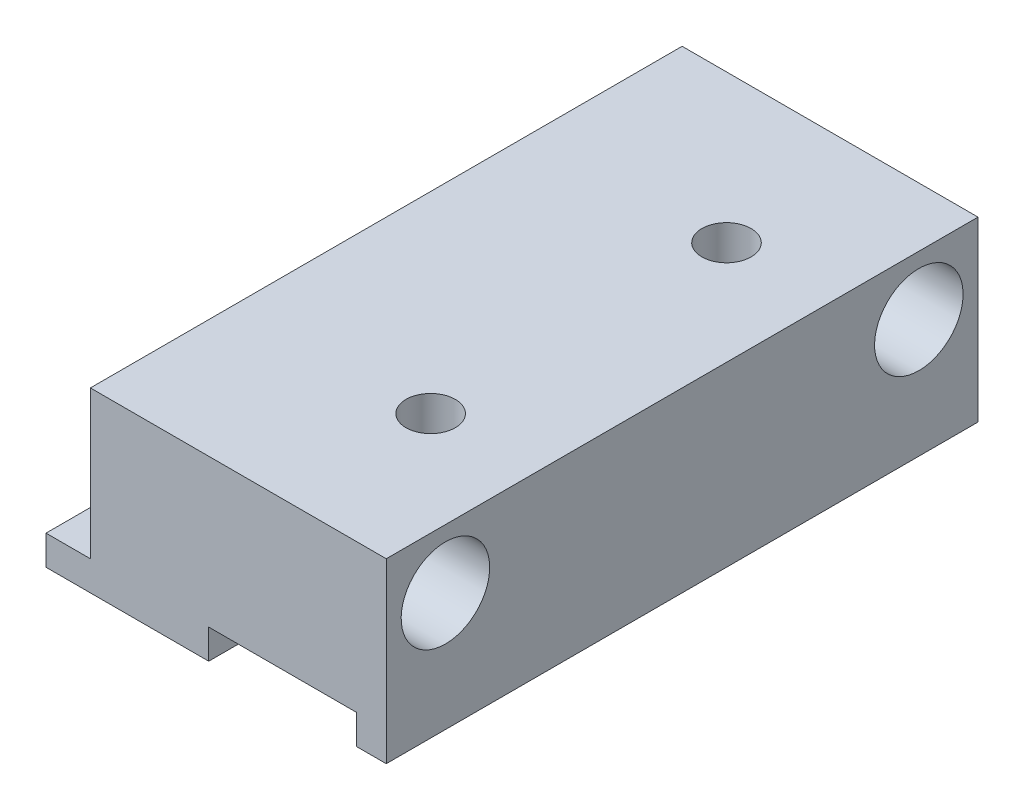
ISO-10303-21;
HEADER;
FILE_DESCRIPTION(('STEP AP214'),'2;1');
FILE_NAME('part.step','',(''),(''),'','','');
FILE_SCHEMA(('AUTOMOTIVE_DESIGN { 1 0 10303 214 1 1 1 1 }'));
ENDSEC;
DATA;
#1=APPLICATION_CONTEXT('core data for automotive mechanical design processes');
#2=APPLICATION_PROTOCOL_DEFINITION('international standard','automotive_design',2000,#1);
#3=PRODUCT_CONTEXT('',#1,'mechanical');
#4=PRODUCT('Part','Part','',(#3));
#5=PRODUCT_RELATED_PRODUCT_CATEGORY('part','',(#4));
#6=PRODUCT_DEFINITION_FORMATION('','',#4);
#7=PRODUCT_DEFINITION_CONTEXT('part definition',#1,'design');
#8=PRODUCT_DEFINITION('design','',#6,#7);
#9=PRODUCT_DEFINITION_SHAPE('','',#8);
#10=(LENGTH_UNIT() NAMED_UNIT(*) SI_UNIT(.MILLI.,.METRE.));
#11=(NAMED_UNIT(*) PLANE_ANGLE_UNIT() SI_UNIT($,.RADIAN.));
#12=(NAMED_UNIT(*) SI_UNIT($,.STERADIAN.) SOLID_ANGLE_UNIT());
#13=UNCERTAINTY_MEASURE_WITH_UNIT(LENGTH_MEASURE(1.E-05),#10,'distance_accuracy_value','');
#14=(GEOMETRIC_REPRESENTATION_CONTEXT(3) GLOBAL_UNCERTAINTY_ASSIGNED_CONTEXT((#13)) GLOBAL_UNIT_ASSIGNED_CONTEXT((#10,
#11,#12)) REPRESENTATION_CONTEXT('',''));
#15=CARTESIAN_POINT('',(0.,0.,0.));
#16=DIRECTION('',(0.,0.,1.));
#17=DIRECTION('',(1.,0.,0.));
#18=AXIS2_PLACEMENT_3D('',#15,#16,#17);
#19=CARTESIAN_POINT('',(-5.27272727272728,3.43181818181817,40.));
#20=DIRECTION('',(1.,0.,0.));
#21=DIRECTION('',(0.,1.,0.));
#22=AXIS2_PLACEMENT_3D('',#19,#20,#21);
#23=PLANE('',#22);
#24=CARTESIAN_POINT('',(-5.27272727272728,-0.568181818181827,36.));
#25=DIRECTION('',(-1.,0.,0.));
#26=DIRECTION('',(0.,-1.,0.));
#27=AXIS2_PLACEMENT_3D('',#24,#25,#26);
#28=CIRCLE('',#27,2.99122974330423);
#29=CARTESIAN_POINT('',(-5.27272727272728,-3.55941156148605,36.));
#30=VERTEX_POINT('',#29);
#31=EDGE_CURVE('E213',#30,#30,#28,.T.);
#32=ORIENTED_EDGE('',*,*,#31,.F.);
#33=EDGE_LOOP('',(#32));
#34=FACE_BOUND('',#33,.T.);
#35=CARTESIAN_POINT('',(-5.27272727272728,-0.568181818181827,4.));
#36=DIRECTION('',(-1.,0.,0.));
#37=DIRECTION('',(0.,-1.,0.));
#38=AXIS2_PLACEMENT_3D('',#35,#36,#37);
#39=CIRCLE('',#38,2.99122974330423);
#40=CARTESIAN_POINT('',(-5.27272727272728,-3.55941156148605,4.));
#41=VERTEX_POINT('',#40);
#42=EDGE_CURVE('E207',#41,#41,#39,.T.);
#43=ORIENTED_EDGE('',*,*,#42,.F.);
#44=EDGE_LOOP('',(#43));
#45=FACE_BOUND('',#44,.T.);
#46=DIRECTION('',(0.,-1.,0.));
#47=VECTOR('',#46,1.);
#48=CARTESIAN_POINT('',(-5.27272727272728,3.43181818181817,0.));
#49=LINE('',#48,#47);
#50=CARTESIAN_POINT('',(-5.27272727272728,3.43181818181817,0.));
#51=VERTEX_POINT('',#50);
#52=CARTESIAN_POINT('',(-5.27272727272728,-6.56818181818183,0.));
#53=VERTEX_POINT('',#52);
#54=EDGE_CURVE('E141',#51,#53,#49,.T.);
#55=ORIENTED_EDGE('',*,*,#54,.T.);
#56=DIRECTION('',(0.,0.,-1.));
#57=VECTOR('',#56,1.);
#58=CARTESIAN_POINT('',(-5.27272727272728,-6.56818181818183,40.));
#59=LINE('',#58,#57);
#60=CARTESIAN_POINT('',(-5.27272727272728,-6.56818181818183,40.));
#61=VERTEX_POINT('',#60);
#62=EDGE_CURVE('E11',#61,#53,#59,.T.);
#63=ORIENTED_EDGE('',*,*,#62,.F.);
#64=DIRECTION('',(0.,-1.,0.));
#65=VECTOR('',#64,1.);
#66=CARTESIAN_POINT('',(-5.27272727272728,3.43181818181817,40.));
#67=LINE('',#66,#65);
#68=CARTESIAN_POINT('',(-5.27272727272728,3.43181818181817,40.));
#69=VERTEX_POINT('',#68);
#70=EDGE_CURVE('E160',#69,#61,#67,.T.);
#71=ORIENTED_EDGE('',*,*,#70,.F.);
#72=DIRECTION('',(0.,0.,-1.));
#73=VECTOR('',#72,1.);
#74=CARTESIAN_POINT('',(-5.27272727272728,3.43181818181817,40.));
#75=LINE('',#74,#73);
#76=EDGE_CURVE('E137',#69,#51,#75,.T.);
#77=ORIENTED_EDGE('',*,*,#76,.T.);
#78=EDGE_LOOP('',(#55,#63,#71,#77));
#79=FACE_BOUND('',#78,.T.);
#80=ADVANCED_FACE('F33',(#34,#45,#79),#23,.F.);
#81=CARTESIAN_POINT('',(-5.27272727272728,-6.56818181818183,40.));
#82=DIRECTION('',(0.,-1.,0.));
#83=DIRECTION('',(0.,0.,-1.));
#84=AXIS2_PLACEMENT_3D('',#81,#82,#83);
#85=PLANE('',#84);
#86=DIRECTION('',(-1.,0.,0.));
#87=VECTOR('',#86,1.);
#88=CARTESIAN_POINT('',(-5.27272727272728,-6.56818181818183,0.));
#89=LINE('',#88,#87);
#90=CARTESIAN_POINT('',(-8.27272727272728,-6.56818181818183,0.));
#91=VERTEX_POINT('',#90);
#92=EDGE_CURVE('E144',#53,#91,#89,.T.);
#93=ORIENTED_EDGE('',*,*,#92,.T.);
#94=DIRECTION('',(0.,0.,-1.));
#95=VECTOR('',#94,1.);
#96=CARTESIAN_POINT('',(-8.27272727272728,-6.56818181818183,40.));
#97=LINE('',#96,#95);
#98=CARTESIAN_POINT('',(-8.27272727272728,-6.56818181818183,40.));
#99=VERTEX_POINT('',#98);
#100=EDGE_CURVE('E41',#99,#91,#97,.T.);
#101=ORIENTED_EDGE('',*,*,#100,.F.);
#102=DIRECTION('',(-1.,0.,0.));
#103=VECTOR('',#102,1.);
#104=CARTESIAN_POINT('',(-5.27272727272728,-6.56818181818183,40.));
#105=LINE('',#104,#103);
#106=EDGE_CURVE('E98',#61,#99,#105,.T.);
#107=ORIENTED_EDGE('',*,*,#106,.F.);
#108=ORIENTED_EDGE('',*,*,#62,.T.);
#109=EDGE_LOOP('',(#93,#101,#107,#108));
#110=FACE_BOUND('',#109,.T.);
#111=ADVANCED_FACE('F259',(#110),#85,.F.);
#112=CARTESIAN_POINT('',(-8.27272727272728,-8.56818181818183,40.));
#113=DIRECTION('',(1.,0.,0.));
#114=DIRECTION('',(0.,0.,-1.));
#115=AXIS2_PLACEMENT_3D('',#112,#113,#114);
#116=PLANE('',#115);
#117=DIRECTION('',(0.,-1.,0.));
#118=VECTOR('',#117,1.);
#119=CARTESIAN_POINT('',(-8.27272727272728,-8.56818181818183,0.));
#120=LINE('',#119,#118);
#121=CARTESIAN_POINT('',(-8.27272727272728,-8.56818181818183,0.));
#122=VERTEX_POINT('',#121);
#123=EDGE_CURVE('E147',#91,#122,#120,.T.);
#124=ORIENTED_EDGE('',*,*,#123,.T.);
#125=DIRECTION('',(0.,0.,-1.));
#126=VECTOR('',#125,1.);
#127=CARTESIAN_POINT('',(-8.27272727272728,-8.56818181818183,40.));
#128=LINE('',#127,#126);
#129=CARTESIAN_POINT('',(-8.27272727272728,-8.56818181818183,40.));
#130=VERTEX_POINT('',#129);
#131=EDGE_CURVE('E173',#130,#122,#128,.T.);
#132=ORIENTED_EDGE('',*,*,#131,.F.);
#133=DIRECTION('',(0.,-1.,0.));
#134=VECTOR('',#133,1.);
#135=CARTESIAN_POINT('',(-8.27272727272728,-8.56818181818183,40.));
#136=LINE('',#135,#134);
#137=EDGE_CURVE('E181',#99,#130,#136,.T.);
#138=ORIENTED_EDGE('',*,*,#137,.F.);
#139=ORIENTED_EDGE('',*,*,#100,.T.);
#140=EDGE_LOOP('',(#124,#132,#138,#139));
#141=FACE_BOUND('',#140,.T.);
#142=ADVANCED_FACE('F179',(#141),#116,.F.);
#143=CARTESIAN_POINT('',(-8.27272727272728,-8.56818181818183,40.));
#144=DIRECTION('',(0.,1.,0.));
#145=DIRECTION('',(0.,0.,1.));
#146=AXIS2_PLACEMENT_3D('',#143,#144,#145);
#147=PLANE('',#146);
#148=DIRECTION('',(1.,0.,0.));
#149=VECTOR('',#148,1.);
#150=CARTESIAN_POINT('',(-8.27272727272728,-8.56818181818183,0.));
#151=LINE('',#150,#149);
#152=CARTESIAN_POINT('',(2.72727272727272,-8.56818181818183,0.));
#153=VERTEX_POINT('',#152);
#154=EDGE_CURVE('E149',#122,#153,#151,.T.);
#155=ORIENTED_EDGE('',*,*,#154,.T.);
#156=DIRECTION('',(0.,0.,-1.));
#157=VECTOR('',#156,1.);
#158=CARTESIAN_POINT('',(2.72727272727272,-8.56818181818183,40.));
#159=LINE('',#158,#157);
#160=CARTESIAN_POINT('',(2.72727272727272,-8.56818181818183,40.));
#161=VERTEX_POINT('',#160);
#162=EDGE_CURVE('E170',#161,#153,#159,.T.);
#163=ORIENTED_EDGE('',*,*,#162,.F.);
#164=DIRECTION('',(1.,0.,0.));
#165=VECTOR('',#164,1.);
#166=CARTESIAN_POINT('',(-8.27272727272728,-8.56818181818183,40.));
#167=LINE('',#166,#165);
#168=EDGE_CURVE('E199',#130,#161,#167,.T.);
#169=ORIENTED_EDGE('',*,*,#168,.F.);
#170=ORIENTED_EDGE('',*,*,#131,.T.);
#171=EDGE_LOOP('',(#155,#163,#169,#170));
#172=FACE_BOUND('',#171,.T.);
#173=ADVANCED_FACE('F190',(#172),#147,.F.);
#174=CARTESIAN_POINT('',(2.72727272727272,-8.56818181818183,40.));
#175=DIRECTION('',(-1.,0.,0.));
#176=DIRECTION('',(0.,0.,1.));
#177=AXIS2_PLACEMENT_3D('',#174,#175,#176);
#178=PLANE('',#177);
#179=DIRECTION('',(0.,1.,0.));
#180=VECTOR('',#179,1.);
#181=CARTESIAN_POINT('',(2.72727272727272,-8.56818181818183,0.));
#182=LINE('',#181,#180);
#183=CARTESIAN_POINT('',(2.72727272727272,-6.56818181818183,0.));
#184=VERTEX_POINT('',#183);
#185=EDGE_CURVE('E151',#153,#184,#182,.T.);
#186=ORIENTED_EDGE('',*,*,#185,.T.);
#187=DIRECTION('',(0.,0.,-1.));
#188=VECTOR('',#187,1.);
#189=CARTESIAN_POINT('',(2.72727272727272,-6.56818181818183,40.));
#190=LINE('',#189,#188);
#191=CARTESIAN_POINT('',(2.72727272727272,-6.56818181818183,40.));
#192=VERTEX_POINT('',#191);
#193=EDGE_CURVE('E167',#192,#184,#190,.T.);
#194=ORIENTED_EDGE('',*,*,#193,.F.);
#195=DIRECTION('',(0.,1.,0.));
#196=VECTOR('',#195,1.);
#197=CARTESIAN_POINT('',(2.72727272727272,-8.56818181818183,40.));
#198=LINE('',#197,#196);
#199=EDGE_CURVE('E196',#161,#192,#198,.T.);
#200=ORIENTED_EDGE('',*,*,#199,.F.);
#201=ORIENTED_EDGE('',*,*,#162,.T.);
#202=EDGE_LOOP('',(#186,#194,#200,#201));
#203=FACE_BOUND('',#202,.T.);
#204=ADVANCED_FACE('F194',(#203),#178,.F.);
#205=CARTESIAN_POINT('',(12.7272727272727,-6.56818181818183,40.));
#206=DIRECTION('',(0.,1.,0.));
#207=DIRECTION('',(0.,0.,1.));
#208=AXIS2_PLACEMENT_3D('',#205,#206,#207);
#209=PLANE('',#208);
#210=CARTESIAN_POINT('',(7.72727272727272,-6.56818181818183,10.));
#211=DIRECTION('',(0.,1.,0.));
#212=DIRECTION('',(0.,0.,1.));
#213=AXIS2_PLACEMENT_3D('',#210,#211,#212);
#214=CIRCLE('',#213,1.66445402286207);
#215=CARTESIAN_POINT('',(7.72727272727272,-6.56818181818183,11.6644540228621));
#216=VERTEX_POINT('',#215);
#217=EDGE_CURVE('E224',#216,#216,#214,.T.);
#218=ORIENTED_EDGE('',*,*,#217,.T.);
#219=EDGE_LOOP('',(#218));
#220=FACE_BOUND('',#219,.T.);
#221=CARTESIAN_POINT('',(7.72727272727272,-6.56818181818183,30.));
#222=DIRECTION('',(0.,1.,0.));
#223=DIRECTION('',(0.,0.,1.));
#224=AXIS2_PLACEMENT_3D('',#221,#222,#223);
#225=CIRCLE('',#224,1.66445402286207);
#226=CARTESIAN_POINT('',(7.72727272727272,-6.56818181818183,31.6644540228621));
#227=VERTEX_POINT('',#226);
#228=EDGE_CURVE('E216',#227,#227,#225,.T.);
#229=ORIENTED_EDGE('',*,*,#228,.T.);
#230=EDGE_LOOP('',(#229));
#231=FACE_BOUND('',#230,.T.);
#232=DIRECTION('',(1.,0.,0.));
#233=VECTOR('',#232,1.);
#234=CARTESIAN_POINT('',(12.7272727272727,-6.56818181818183,0.));
#235=LINE('',#234,#233);
#236=CARTESIAN_POINT('',(12.7272727272727,-6.56818181818183,0.));
#237=VERTEX_POINT('',#236);
#238=EDGE_CURVE('E153',#184,#237,#235,.T.);
#239=ORIENTED_EDGE('',*,*,#238,.T.);
#240=DIRECTION('',(0.,0.,-1.));
#241=VECTOR('',#240,1.);
#242=CARTESIAN_POINT('',(12.7272727272727,-6.56818181818183,40.));
#243=LINE('',#242,#241);
#244=CARTESIAN_POINT('',(12.7272727272727,-6.56818181818183,40.));
#245=VERTEX_POINT('',#244);
#246=EDGE_CURVE('E164',#245,#237,#243,.T.);
#247=ORIENTED_EDGE('',*,*,#246,.F.);
#248=DIRECTION('',(1.,0.,0.));
#249=VECTOR('',#248,1.);
#250=CARTESIAN_POINT('',(12.7272727272727,-6.56818181818183,40.));
#251=LINE('',#250,#249);
#252=EDGE_CURVE('E198',#192,#245,#251,.T.);
#253=ORIENTED_EDGE('',*,*,#252,.F.);
#254=ORIENTED_EDGE('',*,*,#193,.T.);
#255=EDGE_LOOP('',(#239,#247,#253,#254));
#256=FACE_BOUND('',#255,.T.);
#257=ADVANCED_FACE('F247',(#220,#231,#256),#209,.F.);
#258=CARTESIAN_POINT('',(12.7272727272727,-8.56818181818183,40.));
#259=DIRECTION('',(1.,0.,0.));
#260=DIRECTION('',(0.,1.,0.));
#261=AXIS2_PLACEMENT_3D('',#258,#259,#260);
#262=PLANE('',#261);
#263=DIRECTION('',(0.,-1.,0.));
#264=VECTOR('',#263,1.);
#265=CARTESIAN_POINT('',(12.7272727272727,-8.56818181818183,0.));
#266=LINE('',#265,#264);
#267=CARTESIAN_POINT('',(12.7272727272727,-8.56818181818183,0.));
#268=VERTEX_POINT('',#267);
#269=EDGE_CURVE('E155',#237,#268,#266,.T.);
#270=ORIENTED_EDGE('',*,*,#269,.T.);
#271=DIRECTION('',(0.,0.,-1.));
#272=VECTOR('',#271,1.);
#273=CARTESIAN_POINT('',(12.7272727272727,-8.56818181818183,40.));
#274=LINE('',#273,#272);
#275=CARTESIAN_POINT('',(12.7272727272727,-8.56818181818183,40.));
#276=VERTEX_POINT('',#275);
#277=EDGE_CURVE('E132',#276,#268,#274,.T.);
#278=ORIENTED_EDGE('',*,*,#277,.F.);
#279=DIRECTION('',(0.,-1.,0.));
#280=VECTOR('',#279,1.);
#281=CARTESIAN_POINT('',(12.7272727272727,-8.56818181818183,40.));
#282=LINE('',#281,#280);
#283=EDGE_CURVE('E123',#245,#276,#282,.T.);
#284=ORIENTED_EDGE('',*,*,#283,.F.);
#285=ORIENTED_EDGE('',*,*,#246,.T.);
#286=EDGE_LOOP('',(#270,#278,#284,#285));
#287=FACE_BOUND('',#286,.T.);
#288=ADVANCED_FACE('F250',(#287),#262,.F.);
#289=CARTESIAN_POINT('',(12.7272727272727,-8.56818181818183,40.));
#290=DIRECTION('',(0.,1.,0.));
#291=DIRECTION('',(0.,0.,1.));
#292=AXIS2_PLACEMENT_3D('',#289,#290,#291);
#293=PLANE('',#292);
#294=DIRECTION('',(1.,0.,0.));
#295=VECTOR('',#294,1.);
#296=CARTESIAN_POINT('',(12.7272727272727,-8.56818181818183,0.));
#297=LINE('',#296,#295);
#298=CARTESIAN_POINT('',(14.7272727272727,-8.56818181818183,0.));
#299=VERTEX_POINT('',#298);
#300=EDGE_CURVE('E131',#268,#299,#297,.T.);
#301=ORIENTED_EDGE('',*,*,#300,.T.);
#302=DIRECTION('',(0.,0.,-1.));
#303=VECTOR('',#302,1.);
#304=CARTESIAN_POINT('',(14.7272727272727,-8.56818181818183,40.));
#305=LINE('',#304,#303);
#306=CARTESIAN_POINT('',(14.7272727272727,-8.56818181818183,40.));
#307=VERTEX_POINT('',#306);
#308=EDGE_CURVE('E128',#307,#299,#305,.T.);
#309=ORIENTED_EDGE('',*,*,#308,.F.);
#310=DIRECTION('',(1.,0.,0.));
#311=VECTOR('',#310,1.);
#312=CARTESIAN_POINT('',(12.7272727272727,-8.56818181818183,40.));
#313=LINE('',#312,#311);
#314=EDGE_CURVE('E117',#276,#307,#313,.T.);
#315=ORIENTED_EDGE('',*,*,#314,.F.);
#316=ORIENTED_EDGE('',*,*,#277,.T.);
#317=EDGE_LOOP('',(#301,#309,#315,#316));
#318=FACE_BOUND('',#317,.T.);
#319=ADVANCED_FACE('F129',(#318),#293,.F.);
#320=CARTESIAN_POINT('',(14.7272727272727,3.43181818181817,40.));
#321=DIRECTION('',(-1.,0.,0.));
#322=DIRECTION('',(0.,-1.,0.));
#323=AXIS2_PLACEMENT_3D('',#320,#321,#322);
#324=PLANE('',#323);
#325=CARTESIAN_POINT('',(14.7272727272727,-0.568181818181829,36.));
#326=DIRECTION('',(-1.,0.,0.));
#327=DIRECTION('',(0.,-1.,0.));
#328=AXIS2_PLACEMENT_3D('',#325,#326,#327);
#329=CIRCLE('',#328,2.99122974330423);
#330=CARTESIAN_POINT('',(14.7272727272727,-3.55941156148605,36.));
#331=VERTEX_POINT('',#330);
#332=EDGE_CURVE('E210',#331,#331,#329,.T.);
#333=ORIENTED_EDGE('',*,*,#332,.T.);
#334=EDGE_LOOP('',(#333));
#335=FACE_BOUND('',#334,.T.);
#336=CARTESIAN_POINT('',(14.7272727272727,-0.568181818181829,4.));
#337=DIRECTION('',(-1.,0.,0.));
#338=DIRECTION('',(0.,-1.,0.));
#339=AXIS2_PLACEMENT_3D('',#336,#337,#338);
#340=CIRCLE('',#339,2.99122974330423);
#341=CARTESIAN_POINT('',(14.7272727272727,-3.55941156148606,4.));
#342=VERTEX_POINT('',#341);
#343=EDGE_CURVE('E145',#342,#342,#340,.T.);
#344=ORIENTED_EDGE('',*,*,#343,.T.);
#345=EDGE_LOOP('',(#344));
#346=FACE_BOUND('',#345,.T.);
#347=DIRECTION('',(0.,1.,0.));
#348=VECTOR('',#347,1.);
#349=CARTESIAN_POINT('',(14.7272727272727,3.43181818181817,0.));
#350=LINE('',#349,#348);
#351=CARTESIAN_POINT('',(14.7272727272727,3.43181818181817,0.));
#352=VERTEX_POINT('',#351);
#353=EDGE_CURVE('E84',#299,#352,#350,.T.);
#354=ORIENTED_EDGE('',*,*,#353,.T.);
#355=DIRECTION('',(0.,0.,-1.));
#356=VECTOR('',#355,1.);
#357=CARTESIAN_POINT('',(14.7272727272727,3.43181818181817,40.));
#358=LINE('',#357,#356);
#359=CARTESIAN_POINT('',(14.7272727272727,3.43181818181817,40.));
#360=VERTEX_POINT('',#359);
#361=EDGE_CURVE('E133',#360,#352,#358,.T.);
#362=ORIENTED_EDGE('',*,*,#361,.F.);
#363=DIRECTION('',(0.,1.,0.));
#364=VECTOR('',#363,1.);
#365=CARTESIAN_POINT('',(14.7272727272727,3.43181818181817,40.));
#366=LINE('',#365,#364);
#367=EDGE_CURVE('E121',#307,#360,#366,.T.);
#368=ORIENTED_EDGE('',*,*,#367,.F.);
#369=ORIENTED_EDGE('',*,*,#308,.T.);
#370=EDGE_LOOP('',(#354,#362,#368,#369));
#371=FACE_BOUND('',#370,.T.);
#372=ADVANCED_FACE('F135',(#335,#346,#371),#324,.F.);
#373=CARTESIAN_POINT('',(-5.27272727272728,3.43181818181817,40.));
#374=DIRECTION('',(0.,-1.,0.));
#375=DIRECTION('',(0.,0.,-1.));
#376=AXIS2_PLACEMENT_3D('',#373,#374,#375);
#377=PLANE('',#376);
#378=CARTESIAN_POINT('',(7.72727272727272,3.43181818181817,10.));
#379=DIRECTION('',(0.,1.,0.));
#380=DIRECTION('',(0.,0.,1.));
#381=AXIS2_PLACEMENT_3D('',#378,#379,#380);
#382=CIRCLE('',#381,1.66445402286207);
#383=CARTESIAN_POINT('',(7.72727272727272,3.43181818181817,11.6644540228621));
#384=VERTEX_POINT('',#383);
#385=EDGE_CURVE('E227',#384,#384,#382,.T.);
#386=ORIENTED_EDGE('',*,*,#385,.F.);
#387=EDGE_LOOP('',(#386));
#388=FACE_BOUND('',#387,.T.);
#389=CARTESIAN_POINT('',(7.72727272727272,3.43181818181817,30.));
#390=DIRECTION('',(0.,1.,0.));
#391=DIRECTION('',(0.,0.,1.));
#392=AXIS2_PLACEMENT_3D('',#389,#390,#391);
#393=CIRCLE('',#392,1.66445402286207);
#394=CARTESIAN_POINT('',(7.72727272727272,3.43181818181817,31.6644540228621));
#395=VERTEX_POINT('',#394);
#396=EDGE_CURVE('E221',#395,#395,#393,.T.);
#397=ORIENTED_EDGE('',*,*,#396,.F.);
#398=EDGE_LOOP('',(#397));
#399=FACE_BOUND('',#398,.T.);
#400=DIRECTION('',(-1.,0.,0.));
#401=VECTOR('',#400,1.);
#402=CARTESIAN_POINT('',(-5.27272727272728,3.43181818181817,0.));
#403=LINE('',#402,#401);
#404=EDGE_CURVE('E90',#352,#51,#403,.T.);
#405=ORIENTED_EDGE('',*,*,#404,.T.);
#406=ORIENTED_EDGE('',*,*,#76,.F.);
#407=DIRECTION('',(-1.,0.,0.));
#408=VECTOR('',#407,1.);
#409=CARTESIAN_POINT('',(-5.27272727272728,3.43181818181817,40.));
#410=LINE('',#409,#408);
#411=EDGE_CURVE('E49',#360,#69,#410,.T.);
#412=ORIENTED_EDGE('',*,*,#411,.F.);
#413=ORIENTED_EDGE('',*,*,#361,.T.);
#414=EDGE_LOOP('',(#405,#406,#412,#413));
#415=FACE_BOUND('',#414,.T.);
#416=ADVANCED_FACE('F234',(#388,#399,#415),#377,.F.);
#417=CARTESIAN_POINT('',(0.,0.,40.));
#418=DIRECTION('',(0.,0.,-1.));
#419=DIRECTION('',(-1.,0.,0.));
#420=AXIS2_PLACEMENT_3D('',#417,#418,#419);
#421=PLANE('',#420);
#422=ORIENTED_EDGE('',*,*,#70,.T.);
#423=ORIENTED_EDGE('',*,*,#106,.T.);
#424=ORIENTED_EDGE('',*,*,#137,.T.);
#425=ORIENTED_EDGE('',*,*,#168,.T.);
#426=ORIENTED_EDGE('',*,*,#199,.T.);
#427=ORIENTED_EDGE('',*,*,#252,.T.);
#428=ORIENTED_EDGE('',*,*,#283,.T.);
#429=ORIENTED_EDGE('',*,*,#314,.T.);
#430=ORIENTED_EDGE('',*,*,#367,.T.);
#431=ORIENTED_EDGE('',*,*,#411,.T.);
#432=EDGE_LOOP('',(#422,#423,#424,#425,#426,#427,#428,#429,#430,#431));
#433=FACE_BOUND('',#432,.T.);
#434=ADVANCED_FACE('F119',(#433),#421,.F.);
#435=CARTESIAN_POINT('',(0.,0.,0.));
#436=DIRECTION('',(0.,0.,-1.));
#437=DIRECTION('',(-1.,0.,0.));
#438=AXIS2_PLACEMENT_3D('',#435,#436,#437);
#439=PLANE('',#438);
#440=ORIENTED_EDGE('',*,*,#54,.F.);
#441=ORIENTED_EDGE('',*,*,#404,.F.);
#442=ORIENTED_EDGE('',*,*,#353,.F.);
#443=ORIENTED_EDGE('',*,*,#300,.F.);
#444=ORIENTED_EDGE('',*,*,#269,.F.);
#445=ORIENTED_EDGE('',*,*,#238,.F.);
#446=ORIENTED_EDGE('',*,*,#185,.F.);
#447=ORIENTED_EDGE('',*,*,#154,.F.);
#448=ORIENTED_EDGE('',*,*,#123,.F.);
#449=ORIENTED_EDGE('',*,*,#92,.F.);
#450=EDGE_LOOP('',(#440,#441,#442,#443,#444,#445,#446,#447,#448,#449));
#451=FACE_BOUND('',#450,.T.);
#452=ADVANCED_FACE('F185',(#451),#439,.T.);
#453=CARTESIAN_POINT('',(14.7272727272727,-0.568181818181829,4.));
#454=DIRECTION('',(-1.,0.,0.));
#455=DIRECTION('',(0.,-1.,0.));
#456=AXIS2_PLACEMENT_3D('',#453,#454,#455);
#457=CYLINDRICAL_SURFACE('',#456,2.99122974330423);
#458=ORIENTED_EDGE('',*,*,#343,.F.);
#459=EDGE_LOOP('',(#458));
#460=FACE_BOUND('',#459,.T.);
#461=ORIENTED_EDGE('',*,*,#42,.T.);
#462=EDGE_LOOP('',(#461));
#463=FACE_BOUND('',#462,.T.);
#464=ADVANCED_FACE('F281',(#460,#463),#457,.F.);
#465=CARTESIAN_POINT('',(14.7272727272727,-0.568181818181829,36.));
#466=DIRECTION('',(-1.,0.,0.));
#467=DIRECTION('',(0.,-1.,0.));
#468=AXIS2_PLACEMENT_3D('',#465,#466,#467);
#469=CYLINDRICAL_SURFACE('',#468,2.99122974330423);
#470=ORIENTED_EDGE('',*,*,#332,.F.);
#471=EDGE_LOOP('',(#470));
#472=FACE_BOUND('',#471,.T.);
#473=ORIENTED_EDGE('',*,*,#31,.T.);
#474=EDGE_LOOP('',(#473));
#475=FACE_BOUND('',#474,.T.);
#476=ADVANCED_FACE('F243',(#472,#475),#469,.F.);
#477=CARTESIAN_POINT('',(7.72727272727272,-36.5681818181818,30.));
#478=DIRECTION('',(0.,1.,0.));
#479=DIRECTION('',(0.,0.,1.));
#480=AXIS2_PLACEMENT_3D('',#477,#478,#479);
#481=CYLINDRICAL_SURFACE('',#480,1.66445402286207);
#482=ORIENTED_EDGE('',*,*,#396,.T.);
#483=EDGE_LOOP('',(#482));
#484=FACE_BOUND('',#483,.T.);
#485=ORIENTED_EDGE('',*,*,#228,.F.);
#486=EDGE_LOOP('',(#485));
#487=FACE_BOUND('',#486,.T.);
#488=ADVANCED_FACE('F240',(#484,#487),#481,.F.);
#489=CARTESIAN_POINT('',(7.72727272727272,-36.5681818181818,10.));
#490=DIRECTION('',(0.,1.,0.));
#491=DIRECTION('',(0.,0.,1.));
#492=AXIS2_PLACEMENT_3D('',#489,#490,#491);
#493=CYLINDRICAL_SURFACE('',#492,1.66445402286207);
#494=ORIENTED_EDGE('',*,*,#385,.T.);
#495=EDGE_LOOP('',(#494));
#496=FACE_BOUND('',#495,.T.);
#497=ORIENTED_EDGE('',*,*,#217,.F.);
#498=EDGE_LOOP('',(#497));
#499=FACE_BOUND('',#498,.T.);
#500=ADVANCED_FACE('F231',(#496,#499),#493,.F.);
#501=CLOSED_SHELL('',(#80,#111,#142,#173,#204,#257,#288,#319,#372,#416,#434,#452,#464,#476,#488,#500));
#502=MANIFOLD_SOLID_BREP('B2',#501);
#503=ADVANCED_BREP_SHAPE_REPRESENTATION('',(#18,#502),#14);
#504=SHAPE_DEFINITION_REPRESENTATION(#9,#503);
ENDSEC;
END-ISO-10303-21;
